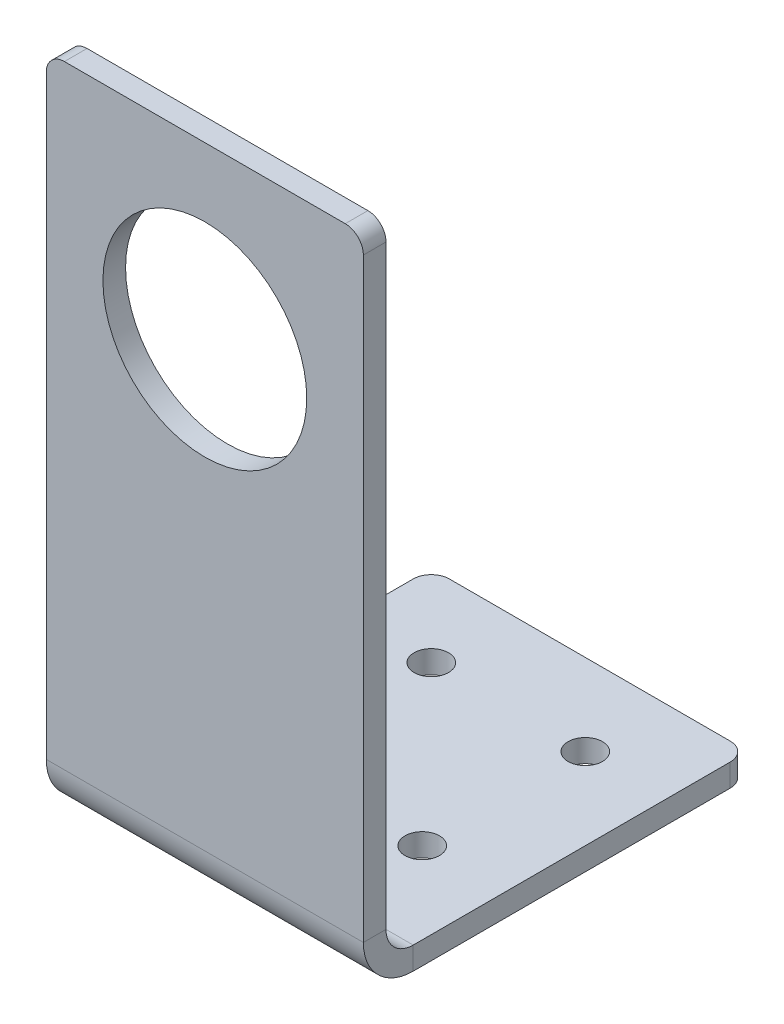
ISO-10303-21;
HEADER;
FILE_DESCRIPTION(('STEP AP214'),'2;1');
FILE_NAME('part.step','',(''),(''),'','','');
FILE_SCHEMA(('AUTOMOTIVE_DESIGN { 1 0 10303 214 1 1 1 1 }'));
ENDSEC;
DATA;
#1=APPLICATION_CONTEXT('core data for automotive mechanical design processes');
#2=APPLICATION_PROTOCOL_DEFINITION('international standard','automotive_design',2000,#1);
#3=PRODUCT_CONTEXT('',#1,'mechanical');
#4=PRODUCT('Part','Part','',(#3));
#5=PRODUCT_RELATED_PRODUCT_CATEGORY('part','',(#4));
#6=PRODUCT_DEFINITION_FORMATION('','',#4);
#7=PRODUCT_DEFINITION_CONTEXT('part definition',#1,'design');
#8=PRODUCT_DEFINITION('design','',#6,#7);
#9=PRODUCT_DEFINITION_SHAPE('','',#8);
#10=(LENGTH_UNIT() NAMED_UNIT(*) SI_UNIT(.MILLI.,.METRE.));
#11=(NAMED_UNIT(*) PLANE_ANGLE_UNIT() SI_UNIT($,.RADIAN.));
#12=(NAMED_UNIT(*) SI_UNIT($,.STERADIAN.) SOLID_ANGLE_UNIT());
#13=UNCERTAINTY_MEASURE_WITH_UNIT(LENGTH_MEASURE(1.E-05),#10,'distance_accuracy_value','');
#14=(GEOMETRIC_REPRESENTATION_CONTEXT(3) GLOBAL_UNCERTAINTY_ASSIGNED_CONTEXT((#13)) GLOBAL_UNIT_ASSIGNED_CONTEXT((#10,
#11,#12)) REPRESENTATION_CONTEXT('',''));
#15=CARTESIAN_POINT('',(0.,0.,0.));
#16=DIRECTION('',(0.,0.,1.));
#17=DIRECTION('',(1.,0.,0.));
#18=AXIS2_PLACEMENT_3D('',#15,#16,#17);
#19=CARTESIAN_POINT('',(22.225,-43.3168727915195,-50.8));
#20=DIRECTION('',(1.,0.,0.));
#21=DIRECTION('',(0.,0.,1.));
#22=AXIS2_PLACEMENT_3D('',#19,#20,#21);
#23=PLANE('',#22);
#24=DIRECTION('',(0.,1.,0.));
#25=VECTOR('',#24,1.);
#26=CARTESIAN_POINT('',(22.225,-43.3168727915195,-3.81));
#27=LINE('',#26,#25);
#28=CARTESIAN_POINT('',(22.225,-46.4918727915195,-3.81));
#29=VERTEX_POINT('',#28);
#30=CARTESIAN_POINT('',(22.225,-43.3168727915195,-3.81));
#31=VERTEX_POINT('',#30);
#32=EDGE_CURVE('E11',#29,#31,#27,.T.);
#33=ORIENTED_EDGE('',*,*,#32,.F.);
#34=DIRECTION('',(0.,0.,1.));
#35=VECTOR('',#34,1.);
#36=CARTESIAN_POINT('',(22.225,-46.4918727915195,-50.8));
#37=LINE('',#36,#35);
#38=CARTESIAN_POINT('',(22.225,-46.4918727915195,-48.26));
#39=VERTEX_POINT('',#38);
#40=EDGE_CURVE('E99',#39,#29,#37,.T.);
#41=ORIENTED_EDGE('',*,*,#40,.F.);
#42=DIRECTION('',(0.,1.,0.));
#43=VECTOR('',#42,1.);
#44=CARTESIAN_POINT('',(22.225,-43.3168727915195,-48.26));
#45=LINE('',#44,#43);
#46=CARTESIAN_POINT('',(22.225,-43.3168727915195,-48.26));
#47=VERTEX_POINT('',#46);
#48=EDGE_CURVE('E46',#39,#47,#45,.T.);
#49=ORIENTED_EDGE('',*,*,#48,.T.);
#50=DIRECTION('',(0.,0.,1.));
#51=VECTOR('',#50,1.);
#52=CARTESIAN_POINT('',(22.225,-43.3168727915195,-50.8));
#53=LINE('',#52,#51);
#54=EDGE_CURVE('E101',#47,#31,#53,.T.);
#55=ORIENTED_EDGE('',*,*,#54,.T.);
#56=EDGE_LOOP('',(#33,#41,#49,#55));
#57=FACE_BOUND('',#56,.T.);
#58=ADVANCED_FACE('F36',(#57),#23,.T.);
#59=CARTESIAN_POINT('',(19.685,-43.3168727915195,-48.26));
#60=DIRECTION('',(0.,-1.,0.));
#61=DIRECTION('',(1.,0.,0.));
#62=AXIS2_PLACEMENT_3D('',#59,#60,#61);
#63=CYLINDRICAL_SURFACE('',#62,2.54);
#64=ORIENTED_EDGE('',*,*,#48,.F.);
#65=CARTESIAN_POINT('',(19.685,-46.4918727915195,-48.26));
#66=DIRECTION('',(0.,-1.,0.));
#67=DIRECTION('',(1.,0.,0.));
#68=AXIS2_PLACEMENT_3D('',#65,#66,#67);
#69=CIRCLE('',#68,2.54);
#70=CARTESIAN_POINT('',(19.685,-46.4918727915195,-50.8));
#71=VERTEX_POINT('',#70);
#72=EDGE_CURVE('E126',#39,#71,#69,.F.);
#73=ORIENTED_EDGE('',*,*,#72,.T.);
#74=DIRECTION('',(0.,1.,0.));
#75=VECTOR('',#74,1.);
#76=CARTESIAN_POINT('',(19.685,-43.3168727915195,-50.8));
#77=LINE('',#76,#75);
#78=CARTESIAN_POINT('',(19.685,-43.3168727915195,-50.8));
#79=VERTEX_POINT('',#78);
#80=EDGE_CURVE('E164',#71,#79,#77,.T.);
#81=ORIENTED_EDGE('',*,*,#80,.T.);
#82=CARTESIAN_POINT('',(19.685,-43.3168727915195,-48.26));
#83=DIRECTION('',(0.,-1.,0.));
#84=DIRECTION('',(1.,0.,0.));
#85=AXIS2_PLACEMENT_3D('',#82,#83,#84);
#86=CIRCLE('',#85,2.54);
#87=EDGE_CURVE('E217',#47,#79,#86,.F.);
#88=ORIENTED_EDGE('',*,*,#87,.F.);
#89=EDGE_LOOP('',(#64,#73,#81,#88));
#90=FACE_BOUND('',#89,.T.);
#91=ADVANCED_FACE('F265',(#90),#63,.T.);
#92=CARTESIAN_POINT('',(22.225,-43.3168727915195,-50.8));
#93=DIRECTION('',(0.,0.,-1.));
#94=DIRECTION('',(1.,0.,0.));
#95=AXIS2_PLACEMENT_3D('',#92,#93,#94);
#96=PLANE('',#95);
#97=ORIENTED_EDGE('',*,*,#80,.F.);
#98=DIRECTION('',(1.,0.,0.));
#99=VECTOR('',#98,1.);
#100=CARTESIAN_POINT('',(22.225,-46.4918727915195,-50.8));
#101=LINE('',#100,#99);
#102=CARTESIAN_POINT('',(-19.685,-46.4918727915195,-50.8));
#103=VERTEX_POINT('',#102);
#104=EDGE_CURVE('E132',#103,#71,#101,.T.);
#105=ORIENTED_EDGE('',*,*,#104,.F.);
#106=DIRECTION('',(0.,1.,0.));
#107=VECTOR('',#106,1.);
#108=CARTESIAN_POINT('',(-19.685,-43.3168727915195,-50.8));
#109=LINE('',#108,#107);
#110=CARTESIAN_POINT('',(-19.685,-43.3168727915195,-50.8));
#111=VERTEX_POINT('',#110);
#112=EDGE_CURVE('E161',#103,#111,#109,.T.);
#113=ORIENTED_EDGE('',*,*,#112,.T.);
#114=DIRECTION('',(1.,0.,0.));
#115=VECTOR('',#114,1.);
#116=CARTESIAN_POINT('',(22.225,-43.3168727915195,-50.8));
#117=LINE('',#116,#115);
#118=EDGE_CURVE('E206',#111,#79,#117,.T.);
#119=ORIENTED_EDGE('',*,*,#118,.T.);
#120=EDGE_LOOP('',(#97,#105,#113,#119));
#121=FACE_BOUND('',#120,.T.);
#122=ADVANCED_FACE('F297',(#121),#96,.T.);
#123=CARTESIAN_POINT('',(-19.685,-43.3168727915195,-48.26));
#124=DIRECTION('',(0.,-1.,0.));
#125=DIRECTION('',(1.,0.,0.));
#126=AXIS2_PLACEMENT_3D('',#123,#124,#125);
#127=CYLINDRICAL_SURFACE('',#126,2.54);
#128=ORIENTED_EDGE('',*,*,#112,.F.);
#129=CARTESIAN_POINT('',(-19.685,-46.4918727915195,-48.26));
#130=DIRECTION('',(0.,-1.,0.));
#131=DIRECTION('',(1.,0.,0.));
#132=AXIS2_PLACEMENT_3D('',#129,#130,#131);
#133=CIRCLE('',#132,2.54);
#134=CARTESIAN_POINT('',(-22.225,-46.4918727915195,-48.26));
#135=VERTEX_POINT('',#134);
#136=EDGE_CURVE('E261',#103,#135,#133,.F.);
#137=ORIENTED_EDGE('',*,*,#136,.T.);
#138=DIRECTION('',(0.,1.,0.));
#139=VECTOR('',#138,1.);
#140=CARTESIAN_POINT('',(-22.225,-43.3168727915195,-48.26));
#141=LINE('',#140,#139);
#142=CARTESIAN_POINT('',(-22.225,-43.3168727915195,-48.26));
#143=VERTEX_POINT('',#142);
#144=EDGE_CURVE('E158',#135,#143,#141,.T.);
#145=ORIENTED_EDGE('',*,*,#144,.T.);
#146=CARTESIAN_POINT('',(-19.685,-43.3168727915195,-48.26));
#147=DIRECTION('',(0.,-1.,0.));
#148=DIRECTION('',(1.,0.,0.));
#149=AXIS2_PLACEMENT_3D('',#146,#147,#148);
#150=CIRCLE('',#149,2.54);
#151=EDGE_CURVE('E209',#111,#143,#150,.F.);
#152=ORIENTED_EDGE('',*,*,#151,.F.);
#153=EDGE_LOOP('',(#128,#137,#145,#152));
#154=FACE_BOUND('',#153,.T.);
#155=ADVANCED_FACE('F301',(#154),#127,.T.);
#156=CARTESIAN_POINT('',(-22.225,-43.3168727915195,-50.8));
#157=DIRECTION('',(1.,0.,0.));
#158=DIRECTION('',(0.,0.,1.));
#159=AXIS2_PLACEMENT_3D('',#156,#157,#158);
#160=PLANE('',#159);
#161=ORIENTED_EDGE('',*,*,#144,.F.);
#162=DIRECTION('',(0.,0.,1.));
#163=VECTOR('',#162,1.);
#164=CARTESIAN_POINT('',(-22.225,-46.4918727915195,-50.8));
#165=LINE('',#164,#163);
#166=CARTESIAN_POINT('',(-22.225,-46.4918727915195,-3.81));
#167=VERTEX_POINT('',#166);
#168=EDGE_CURVE('E127',#135,#167,#165,.T.);
#169=ORIENTED_EDGE('',*,*,#168,.T.);
#170=DIRECTION('',(0.,1.,0.));
#171=VECTOR('',#170,1.);
#172=CARTESIAN_POINT('',(-22.225,-43.3168727915195,-3.81));
#173=LINE('',#172,#171);
#174=CARTESIAN_POINT('',(-22.225,-43.3168727915195,-3.81));
#175=VERTEX_POINT('',#174);
#176=EDGE_CURVE('E155',#167,#175,#173,.T.);
#177=ORIENTED_EDGE('',*,*,#176,.T.);
#178=DIRECTION('',(0.,0.,1.));
#179=VECTOR('',#178,1.);
#180=CARTESIAN_POINT('',(-22.225,-43.3168727915195,-50.8));
#181=LINE('',#180,#179);
#182=EDGE_CURVE('E213',#143,#175,#181,.T.);
#183=ORIENTED_EDGE('',*,*,#182,.F.);
#184=EDGE_LOOP('',(#161,#169,#177,#183));
#185=FACE_BOUND('',#184,.T.);
#186=ADVANCED_FACE('F302',(#185),#160,.F.);
#187=CARTESIAN_POINT('',(-22.225,-39.5068727915195,-3.81));
#188=DIRECTION('',(1.,0.,0.));
#189=DIRECTION('',(0.,0.,-1.));
#190=AXIS2_PLACEMENT_3D('',#187,#188,#189);
#191=PLANE('',#190);
#192=ORIENTED_EDGE('',*,*,#176,.F.);
#193=CARTESIAN_POINT('',(-22.225,-39.5068727915195,-3.81));
#194=DIRECTION('',(1.,0.,0.));
#195=DIRECTION('',(0.,1.,0.));
#196=AXIS2_PLACEMENT_3D('',#193,#194,#195);
#197=CIRCLE('',#196,6.985);
#198=CARTESIAN_POINT('',(-22.225,-39.5068727915195,3.175));
#199=VERTEX_POINT('',#198);
#200=EDGE_CURVE('E115',#167,#199,#197,.F.);
#201=ORIENTED_EDGE('',*,*,#200,.T.);
#202=DIRECTION('',(0.,0.,-1.));
#203=VECTOR('',#202,1.);
#204=CARTESIAN_POINT('',(-22.225,-39.5068727915195,0.));
#205=LINE('',#204,#203);
#206=CARTESIAN_POINT('',(-22.225,-39.5068727915195,0.));
#207=VERTEX_POINT('',#206);
#208=EDGE_CURVE('E153',#199,#207,#205,.T.);
#209=ORIENTED_EDGE('',*,*,#208,.T.);
#210=CARTESIAN_POINT('',(-22.225,-39.5068727915195,-3.81));
#211=DIRECTION('',(-1.,0.,0.));
#212=DIRECTION('',(0.,0.,1.));
#213=AXIS2_PLACEMENT_3D('',#210,#211,#212);
#214=CIRCLE('',#213,3.81);
#215=EDGE_CURVE('E210',#175,#207,#214,.T.);
#216=ORIENTED_EDGE('',*,*,#215,.F.);
#217=EDGE_LOOP('',(#192,#201,#209,#216));
#218=FACE_BOUND('',#217,.T.);
#219=ADVANCED_FACE('F304',(#218),#191,.F.);
#220=CARTESIAN_POINT('',(-22.225,-46.4918727915195,0.));
#221=DIRECTION('',(1.,0.,0.));
#222=DIRECTION('',(0.,-1.,0.));
#223=AXIS2_PLACEMENT_3D('',#220,#221,#222);
#224=PLANE('',#223);
#225=ORIENTED_EDGE('',*,*,#208,.F.);
#226=DIRECTION('',(0.,1.,0.));
#227=VECTOR('',#226,1.);
#228=CARTESIAN_POINT('',(-22.225,43.9518727915195,3.175));
#229=LINE('',#228,#227);
#230=CARTESIAN_POINT('',(-22.225,43.9518727915194,3.175));
#231=VERTEX_POINT('',#230);
#232=EDGE_CURVE('E257',#231,#199,#229,.F.);
#233=ORIENTED_EDGE('',*,*,#232,.F.);
#234=DIRECTION('',(0.,0.,-1.));
#235=VECTOR('',#234,1.);
#236=CARTESIAN_POINT('',(-22.225,43.9518727915194,0.));
#237=LINE('',#236,#235);
#238=CARTESIAN_POINT('',(-22.225,43.9518727915194,0.));
#239=VERTEX_POINT('',#238);
#240=EDGE_CURVE('E150',#231,#239,#237,.T.);
#241=ORIENTED_EDGE('',*,*,#240,.T.);
#242=DIRECTION('',(0.,-1.,0.));
#243=VECTOR('',#242,1.);
#244=CARTESIAN_POINT('',(-22.225,-46.4918727915195,0.));
#245=LINE('',#244,#243);
#246=EDGE_CURVE('E220',#239,#207,#245,.T.);
#247=ORIENTED_EDGE('',*,*,#246,.T.);
#248=EDGE_LOOP('',(#225,#233,#241,#247));
#249=FACE_BOUND('',#248,.T.);
#250=ADVANCED_FACE('F310',(#249),#224,.F.);
#251=CARTESIAN_POINT('',(-19.685,43.9518727915195,0.));
#252=DIRECTION('',(0.,0.,-1.));
#253=DIRECTION('',(-1.,0.,0.));
#254=AXIS2_PLACEMENT_3D('',#251,#252,#253);
#255=CYLINDRICAL_SURFACE('',#254,2.54);
#256=ORIENTED_EDGE('',*,*,#240,.F.);
#257=CARTESIAN_POINT('',(-19.685,43.9518727915195,3.175));
#258=DIRECTION('',(0.,0.,1.));
#259=DIRECTION('',(1.,0.,0.));
#260=AXIS2_PLACEMENT_3D('',#257,#258,#259);
#261=CIRCLE('',#260,2.54);
#262=CARTESIAN_POINT('',(-19.685,46.4918727915195,3.175));
#263=VERTEX_POINT('',#262);
#264=EDGE_CURVE('E254',#263,#231,#261,.T.);
#265=ORIENTED_EDGE('',*,*,#264,.F.);
#266=DIRECTION('',(0.,0.,-1.));
#267=VECTOR('',#266,1.);
#268=CARTESIAN_POINT('',(-19.685,46.4918727915195,0.));
#269=LINE('',#268,#267);
#270=CARTESIAN_POINT('',(-19.685,46.4918727915195,0.));
#271=VERTEX_POINT('',#270);
#272=EDGE_CURVE('E147',#263,#271,#269,.T.);
#273=ORIENTED_EDGE('',*,*,#272,.T.);
#274=CARTESIAN_POINT('',(-19.685,43.9518727915195,0.));
#275=DIRECTION('',(0.,0.,1.));
#276=DIRECTION('',(-1.,0.,0.));
#277=AXIS2_PLACEMENT_3D('',#274,#275,#276);
#278=CIRCLE('',#277,2.54);
#279=EDGE_CURVE('E223',#271,#239,#278,.T.);
#280=ORIENTED_EDGE('',*,*,#279,.T.);
#281=EDGE_LOOP('',(#256,#265,#273,#280));
#282=FACE_BOUND('',#281,.T.);
#283=ADVANCED_FACE('F341',(#282),#255,.T.);
#284=CARTESIAN_POINT('',(-19.685,46.4918727915195,0.));
#285=DIRECTION('',(0.,-1.,0.));
#286=DIRECTION('',(-1.,0.,0.));
#287=AXIS2_PLACEMENT_3D('',#284,#285,#286);
#288=PLANE('',#287);
#289=ORIENTED_EDGE('',*,*,#272,.F.);
#290=DIRECTION('',(-1.,0.,0.));
#291=VECTOR('',#290,1.);
#292=CARTESIAN_POINT('',(-19.685,46.4918727915195,3.175));
#293=LINE('',#292,#291);
#294=CARTESIAN_POINT('',(19.685,46.4918727915195,3.175));
#295=VERTEX_POINT('',#294);
#296=EDGE_CURVE('E251',#295,#263,#293,.T.);
#297=ORIENTED_EDGE('',*,*,#296,.F.);
#298=DIRECTION('',(0.,0.,-1.));
#299=VECTOR('',#298,1.);
#300=CARTESIAN_POINT('',(19.685,46.4918727915195,0.));
#301=LINE('',#300,#299);
#302=CARTESIAN_POINT('',(19.685,46.4918727915195,0.));
#303=VERTEX_POINT('',#302);
#304=EDGE_CURVE('E144',#295,#303,#301,.T.);
#305=ORIENTED_EDGE('',*,*,#304,.T.);
#306=DIRECTION('',(-1.,0.,0.));
#307=VECTOR('',#306,1.);
#308=CARTESIAN_POINT('',(-19.685,46.4918727915195,0.));
#309=LINE('',#308,#307);
#310=EDGE_CURVE('E226',#303,#271,#309,.T.);
#311=ORIENTED_EDGE('',*,*,#310,.T.);
#312=EDGE_LOOP('',(#289,#297,#305,#311));
#313=FACE_BOUND('',#312,.T.);
#314=ADVANCED_FACE('F334',(#313),#288,.F.);
#315=CARTESIAN_POINT('',(19.685,43.9518727915195,0.));
#316=DIRECTION('',(0.,0.,-1.));
#317=DIRECTION('',(-1.,0.,0.));
#318=AXIS2_PLACEMENT_3D('',#315,#316,#317);
#319=CYLINDRICAL_SURFACE('',#318,2.54);
#320=ORIENTED_EDGE('',*,*,#304,.F.);
#321=CARTESIAN_POINT('',(19.685,43.9518727915195,3.175));
#322=DIRECTION('',(0.,0.,1.));
#323=DIRECTION('',(1.,0.,0.));
#324=AXIS2_PLACEMENT_3D('',#321,#322,#323);
#325=CIRCLE('',#324,2.54);
#326=CARTESIAN_POINT('',(22.225,43.9518727915194,3.175));
#327=VERTEX_POINT('',#326);
#328=EDGE_CURVE('E248',#327,#295,#325,.T.);
#329=ORIENTED_EDGE('',*,*,#328,.F.);
#330=DIRECTION('',(0.,0.,-1.));
#331=VECTOR('',#330,1.);
#332=CARTESIAN_POINT('',(22.225,43.9518727915194,0.));
#333=LINE('',#332,#331);
#334=CARTESIAN_POINT('',(22.225,43.9518727915194,0.));
#335=VERTEX_POINT('',#334);
#336=EDGE_CURVE('E141',#327,#335,#333,.T.);
#337=ORIENTED_EDGE('',*,*,#336,.T.);
#338=CARTESIAN_POINT('',(19.685,43.9518727915195,0.));
#339=DIRECTION('',(0.,0.,1.));
#340=DIRECTION('',(1.,0.,0.));
#341=AXIS2_PLACEMENT_3D('',#338,#339,#340);
#342=CIRCLE('',#341,2.54);
#343=EDGE_CURVE('E229',#335,#303,#342,.T.);
#344=ORIENTED_EDGE('',*,*,#343,.T.);
#345=EDGE_LOOP('',(#320,#329,#337,#344));
#346=FACE_BOUND('',#345,.T.);
#347=ADVANCED_FACE('F329',(#346),#319,.T.);
#348=CARTESIAN_POINT('',(22.225,-46.4918727915195,0.));
#349=DIRECTION('',(-1.,0.,0.));
#350=DIRECTION('',(0.,1.,0.));
#351=AXIS2_PLACEMENT_3D('',#348,#349,#350);
#352=PLANE('',#351);
#353=ORIENTED_EDGE('',*,*,#336,.F.);
#354=DIRECTION('',(0.,1.,0.));
#355=VECTOR('',#354,1.);
#356=CARTESIAN_POINT('',(22.225,43.9518727915195,3.175));
#357=LINE('',#356,#355);
#358=CARTESIAN_POINT('',(22.225,-39.5068727915195,3.175));
#359=VERTEX_POINT('',#358);
#360=EDGE_CURVE('E140',#359,#327,#357,.T.);
#361=ORIENTED_EDGE('',*,*,#360,.F.);
#362=DIRECTION('',(0.,0.,-1.));
#363=VECTOR('',#362,1.);
#364=CARTESIAN_POINT('',(22.225,-39.5068727915195,0.));
#365=LINE('',#364,#363);
#366=CARTESIAN_POINT('',(22.225,-39.5068727915195,0.));
#367=VERTEX_POINT('',#366);
#368=EDGE_CURVE('E55',#359,#367,#365,.T.);
#369=ORIENTED_EDGE('',*,*,#368,.T.);
#370=DIRECTION('',(0.,1.,0.));
#371=VECTOR('',#370,1.);
#372=CARTESIAN_POINT('',(22.225,-46.4918727915195,0.));
#373=LINE('',#372,#371);
#374=EDGE_CURVE('E232',#367,#335,#373,.T.);
#375=ORIENTED_EDGE('',*,*,#374,.T.);
#376=EDGE_LOOP('',(#353,#361,#369,#375));
#377=FACE_BOUND('',#376,.T.);
#378=ADVANCED_FACE('F322',(#377),#352,.F.);
#379=CARTESIAN_POINT('',(22.225,-39.5068727915195,-3.81));
#380=DIRECTION('',(1.,0.,0.));
#381=DIRECTION('',(0.,0.,-1.));
#382=AXIS2_PLACEMENT_3D('',#379,#380,#381);
#383=PLANE('',#382);
#384=CARTESIAN_POINT('',(22.225,-39.5068727915195,-3.81));
#385=DIRECTION('',(1.,0.,0.));
#386=DIRECTION('',(0.,1.,0.));
#387=AXIS2_PLACEMENT_3D('',#384,#385,#386);
#388=CIRCLE('',#387,6.985);
#389=EDGE_CURVE('E113',#359,#29,#388,.T.);
#390=ORIENTED_EDGE('',*,*,#389,.T.);
#391=ORIENTED_EDGE('',*,*,#32,.T.);
#392=CARTESIAN_POINT('',(22.225,-39.5068727915195,-3.81));
#393=DIRECTION('',(-1.,0.,0.));
#394=DIRECTION('',(0.,0.,1.));
#395=AXIS2_PLACEMENT_3D('',#392,#393,#394);
#396=CIRCLE('',#395,3.81);
#397=EDGE_CURVE('E241',#367,#31,#396,.F.);
#398=ORIENTED_EDGE('',*,*,#397,.F.);
#399=ORIENTED_EDGE('',*,*,#368,.F.);
#400=EDGE_LOOP('',(#390,#391,#398,#399));
#401=FACE_BOUND('',#400,.T.);
#402=ADVANCED_FACE('F129',(#401),#383,.T.);
#403=CARTESIAN_POINT('',(0.,22.5961272084805,0.));
#404=DIRECTION('',(0.,0.,-1.));
#405=DIRECTION('',(-1.,0.,0.));
#406=AXIS2_PLACEMENT_3D('',#403,#404,#405);
#407=CYLINDRICAL_SURFACE('',#406,14.2875);
#408=CARTESIAN_POINT('',(0.,22.5961272084805,0.));
#409=DIRECTION('',(0.,0.,1.));
#410=DIRECTION('',(1.,0.,0.));
#411=AXIS2_PLACEMENT_3D('',#408,#409,#410);
#412=CIRCLE('',#411,14.2875);
#413=CARTESIAN_POINT('',(14.2875,22.5961272084805,0.));
#414=VERTEX_POINT('',#413);
#415=EDGE_CURVE('E234',#414,#414,#412,.T.);
#416=ORIENTED_EDGE('',*,*,#415,.F.);
#417=EDGE_LOOP('',(#416));
#418=FACE_BOUND('',#417,.T.);
#419=CARTESIAN_POINT('',(0.,22.5961272084805,3.175));
#420=DIRECTION('',(0.,0.,1.));
#421=DIRECTION('',(1.,0.,0.));
#422=AXIS2_PLACEMENT_3D('',#419,#420,#421);
#423=CIRCLE('',#422,14.2875);
#424=CARTESIAN_POINT('',(14.2875,22.5961272084805,3.175));
#425=VERTEX_POINT('',#424);
#426=EDGE_CURVE('E120',#425,#425,#423,.T.);
#427=ORIENTED_EDGE('',*,*,#426,.T.);
#428=EDGE_LOOP('',(#427));
#429=FACE_BOUND('',#428,.T.);
#430=ADVANCED_FACE('F38',(#418,#429),#407,.F.);
#431=CARTESIAN_POINT('',(-19.685,43.9518727915195,0.));
#432=DIRECTION('',(0.,0.,-1.));
#433=DIRECTION('',(-1.,0.,0.));
#434=AXIS2_PLACEMENT_3D('',#431,#432,#433);
#435=PLANE('',#434);
#436=ORIENTED_EDGE('',*,*,#374,.F.);
#437=DIRECTION('',(1.,0.,0.));
#438=VECTOR('',#437,1.);
#439=CARTESIAN_POINT('',(-19.685,-39.5068727915195,0.));
#440=LINE('',#439,#438);
#441=EDGE_CURVE('E169',#367,#207,#440,.F.);
#442=ORIENTED_EDGE('',*,*,#441,.T.);
#443=ORIENTED_EDGE('',*,*,#246,.F.);
#444=ORIENTED_EDGE('',*,*,#279,.F.);
#445=ORIENTED_EDGE('',*,*,#310,.F.);
#446=ORIENTED_EDGE('',*,*,#343,.F.);
#447=EDGE_LOOP('',(#436,#442,#443,#444,#445,#446));
#448=FACE_BOUND('',#447,.T.);
#449=ORIENTED_EDGE('',*,*,#415,.T.);
#450=EDGE_LOOP('',(#449));
#451=FACE_BOUND('',#450,.T.);
#452=ADVANCED_FACE('F327',(#448,#451),#435,.T.);
#453=CARTESIAN_POINT('',(22.225,-43.3168727915195,-50.8));
#454=DIRECTION('',(0.,-1.,0.));
#455=DIRECTION('',(1.,0.,0.));
#456=AXIS2_PLACEMENT_3D('',#453,#454,#455);
#457=PLANE('',#456);
#458=CARTESIAN_POINT('',(10.795,-43.3168727915195,-39.37));
#459=DIRECTION('',(0.,1.,0.));
#460=DIRECTION('',(-1.,0.,0.));
#461=AXIS2_PLACEMENT_3D('',#458,#459,#460);
#462=CIRCLE('',#461,2.413);
#463=CARTESIAN_POINT('',(8.382,-43.3168727915195,-39.37));
#464=VERTEX_POINT('',#463);
#465=EDGE_CURVE('E199',#464,#464,#462,.T.);
#466=ORIENTED_EDGE('',*,*,#465,.F.);
#467=EDGE_LOOP('',(#466));
#468=FACE_BOUND('',#467,.T.);
#469=CARTESIAN_POINT('',(-10.795,-43.3168727915195,-16.51));
#470=DIRECTION('',(0.,1.,0.));
#471=DIRECTION('',(-1.,0.,0.));
#472=AXIS2_PLACEMENT_3D('',#469,#470,#471);
#473=CIRCLE('',#472,2.413);
#474=CARTESIAN_POINT('',(-13.208,-43.3168727915195,-16.51));
#475=VERTEX_POINT('',#474);
#476=EDGE_CURVE('E202',#475,#475,#473,.T.);
#477=ORIENTED_EDGE('',*,*,#476,.F.);
#478=EDGE_LOOP('',(#477));
#479=FACE_BOUND('',#478,.T.);
#480=CARTESIAN_POINT('',(10.795,-43.3168727915195,-16.51));
#481=DIRECTION('',(0.,1.,0.));
#482=DIRECTION('',(-1.,0.,0.));
#483=AXIS2_PLACEMENT_3D('',#480,#481,#482);
#484=CIRCLE('',#483,2.413);
#485=CARTESIAN_POINT('',(8.382,-43.3168727915195,-16.51));
#486=VERTEX_POINT('',#485);
#487=EDGE_CURVE('E391',#486,#486,#484,.T.);
#488=ORIENTED_EDGE('',*,*,#487,.F.);
#489=EDGE_LOOP('',(#488));
#490=FACE_BOUND('',#489,.T.);
#491=CARTESIAN_POINT('',(-10.795,-43.3168727915195,-39.37));
#492=DIRECTION('',(0.,1.,0.));
#493=DIRECTION('',(-1.,0.,0.));
#494=AXIS2_PLACEMENT_3D('',#491,#492,#493);
#495=CIRCLE('',#494,2.413);
#496=CARTESIAN_POINT('',(-13.208,-43.3168727915195,-39.37));
#497=VERTEX_POINT('',#496);
#498=EDGE_CURVE('E174',#497,#497,#495,.T.);
#499=ORIENTED_EDGE('',*,*,#498,.F.);
#500=EDGE_LOOP('',(#499));
#501=FACE_BOUND('',#500,.T.);
#502=ORIENTED_EDGE('',*,*,#182,.T.);
#503=DIRECTION('',(1.,0.,0.));
#504=VECTOR('',#503,1.);
#505=CARTESIAN_POINT('',(22.225,-43.3168727915195,-3.81));
#506=LINE('',#505,#504);
#507=EDGE_CURVE('E237',#175,#31,#506,.T.);
#508=ORIENTED_EDGE('',*,*,#507,.T.);
#509=ORIENTED_EDGE('',*,*,#54,.F.);
#510=ORIENTED_EDGE('',*,*,#87,.T.);
#511=ORIENTED_EDGE('',*,*,#118,.F.);
#512=ORIENTED_EDGE('',*,*,#151,.T.);
#513=EDGE_LOOP('',(#502,#508,#509,#510,#511,#512));
#514=FACE_BOUND('',#513,.T.);
#515=ADVANCED_FACE('F272',(#468,#479,#490,#501,#514),#457,.F.);
#516=CARTESIAN_POINT('',(22.225,-39.5068727915195,-3.81));
#517=DIRECTION('',(1.,0.,0.));
#518=DIRECTION('',(0.,1.,0.));
#519=AXIS2_PLACEMENT_3D('',#516,#517,#518);
#520=CYLINDRICAL_SURFACE('',#519,3.81);
#521=ORIENTED_EDGE('',*,*,#215,.T.);
#522=ORIENTED_EDGE('',*,*,#441,.F.);
#523=ORIENTED_EDGE('',*,*,#397,.T.);
#524=ORIENTED_EDGE('',*,*,#507,.F.);
#525=EDGE_LOOP('',(#521,#522,#523,#524));
#526=FACE_BOUND('',#525,.T.);
#527=ADVANCED_FACE('F279',(#526),#520,.F.);
#528=CARTESIAN_POINT('',(-19.685,43.9518727915195,3.175));
#529=DIRECTION('',(0.,0.,-1.));
#530=DIRECTION('',(-1.,0.,0.));
#531=AXIS2_PLACEMENT_3D('',#528,#529,#530);
#532=PLANE('',#531);
#533=ORIENTED_EDGE('',*,*,#360,.T.);
#534=ORIENTED_EDGE('',*,*,#328,.T.);
#535=ORIENTED_EDGE('',*,*,#296,.T.);
#536=ORIENTED_EDGE('',*,*,#264,.T.);
#537=ORIENTED_EDGE('',*,*,#232,.T.);
#538=DIRECTION('',(-1.,0.,0.));
#539=VECTOR('',#538,1.);
#540=CARTESIAN_POINT('',(-19.685,-39.5068727915195,3.175));
#541=LINE('',#540,#539);
#542=EDGE_CURVE('E119',#359,#199,#541,.T.);
#543=ORIENTED_EDGE('',*,*,#542,.F.);
#544=EDGE_LOOP('',(#533,#534,#535,#536,#537,#543));
#545=FACE_BOUND('',#544,.T.);
#546=ORIENTED_EDGE('',*,*,#426,.F.);
#547=EDGE_LOOP('',(#546));
#548=FACE_BOUND('',#547,.T.);
#549=ADVANCED_FACE('F184',(#545,#548),#532,.F.);
#550=CARTESIAN_POINT('',(22.225,-46.4918727915195,-50.8));
#551=DIRECTION('',(0.,-1.,0.));
#552=DIRECTION('',(1.,0.,0.));
#553=AXIS2_PLACEMENT_3D('',#550,#551,#552);
#554=PLANE('',#553);
#555=CARTESIAN_POINT('',(10.795,-46.4918727915195,-39.37));
#556=DIRECTION('',(0.,-1.,0.));
#557=DIRECTION('',(1.,0.,0.));
#558=AXIS2_PLACEMENT_3D('',#555,#556,#557);
#559=CIRCLE('',#558,2.413);
#560=CARTESIAN_POINT('',(13.208,-46.4918727915195,-39.37));
#561=VERTEX_POINT('',#560);
#562=EDGE_CURVE('E40',#561,#561,#559,.T.);
#563=ORIENTED_EDGE('',*,*,#562,.F.);
#564=EDGE_LOOP('',(#563));
#565=FACE_BOUND('',#564,.T.);
#566=CARTESIAN_POINT('',(-10.795,-46.4918727915195,-16.51));
#567=DIRECTION('',(0.,-1.,0.));
#568=DIRECTION('',(1.,0.,0.));
#569=AXIS2_PLACEMENT_3D('',#566,#567,#568);
#570=CIRCLE('',#569,2.413);
#571=CARTESIAN_POINT('',(-8.382,-46.4918727915195,-16.51));
#572=VERTEX_POINT('',#571);
#573=EDGE_CURVE('E135',#572,#572,#570,.T.);
#574=ORIENTED_EDGE('',*,*,#573,.F.);
#575=EDGE_LOOP('',(#574));
#576=FACE_BOUND('',#575,.T.);
#577=CARTESIAN_POINT('',(10.795,-46.4918727915195,-16.51));
#578=DIRECTION('',(0.,-1.,0.));
#579=DIRECTION('',(1.,0.,0.));
#580=AXIS2_PLACEMENT_3D('',#577,#578,#579);
#581=CIRCLE('',#580,2.413);
#582=CARTESIAN_POINT('',(13.208,-46.4918727915195,-16.51));
#583=VERTEX_POINT('',#582);
#584=EDGE_CURVE('E173',#583,#583,#581,.T.);
#585=ORIENTED_EDGE('',*,*,#584,.F.);
#586=EDGE_LOOP('',(#585));
#587=FACE_BOUND('',#586,.T.);
#588=CARTESIAN_POINT('',(-10.795,-46.4918727915195,-39.37));
#589=DIRECTION('',(0.,-1.,0.));
#590=DIRECTION('',(1.,0.,0.));
#591=AXIS2_PLACEMENT_3D('',#588,#589,#590);
#592=CIRCLE('',#591,2.413);
#593=CARTESIAN_POINT('',(-8.382,-46.4918727915195,-39.37));
#594=VERTEX_POINT('',#593);
#595=EDGE_CURVE('E170',#594,#594,#592,.T.);
#596=ORIENTED_EDGE('',*,*,#595,.F.);
#597=EDGE_LOOP('',(#596));
#598=FACE_BOUND('',#597,.T.);
#599=ORIENTED_EDGE('',*,*,#168,.F.);
#600=ORIENTED_EDGE('',*,*,#136,.F.);
#601=ORIENTED_EDGE('',*,*,#104,.T.);
#602=ORIENTED_EDGE('',*,*,#72,.F.);
#603=ORIENTED_EDGE('',*,*,#40,.T.);
#604=DIRECTION('',(1.,0.,0.));
#605=VECTOR('',#604,1.);
#606=CARTESIAN_POINT('',(22.225,-46.4918727915195,-3.81));
#607=LINE('',#606,#605);
#608=EDGE_CURVE('E110',#167,#29,#607,.T.);
#609=ORIENTED_EDGE('',*,*,#608,.F.);
#610=EDGE_LOOP('',(#599,#600,#601,#602,#603,#609));
#611=FACE_BOUND('',#610,.T.);
#612=ADVANCED_FACE('F123',(#565,#576,#587,#598,#611),#554,.T.);
#613=CARTESIAN_POINT('',(22.225,-39.5068727915195,-3.81));
#614=DIRECTION('',(1.,0.,0.));
#615=DIRECTION('',(0.,1.,0.));
#616=AXIS2_PLACEMENT_3D('',#613,#614,#615);
#617=CYLINDRICAL_SURFACE('',#616,6.985);
#618=ORIENTED_EDGE('',*,*,#200,.F.);
#619=ORIENTED_EDGE('',*,*,#608,.T.);
#620=ORIENTED_EDGE('',*,*,#389,.F.);
#621=ORIENTED_EDGE('',*,*,#542,.T.);
#622=EDGE_LOOP('',(#618,#619,#620,#621));
#623=FACE_BOUND('',#622,.T.);
#624=ADVANCED_FACE('F111',(#623),#617,.T.);
#625=CARTESIAN_POINT('',(-10.795,-94.1168727915195,-39.37));
#626=DIRECTION('',(0.,1.,0.));
#627=DIRECTION('',(-1.,0.,0.));
#628=AXIS2_PLACEMENT_3D('',#625,#626,#627);
#629=CYLINDRICAL_SURFACE('',#628,2.413);
#630=ORIENTED_EDGE('',*,*,#595,.T.);
#631=EDGE_LOOP('',(#630));
#632=FACE_BOUND('',#631,.T.);
#633=ORIENTED_EDGE('',*,*,#498,.T.);
#634=EDGE_LOOP('',(#633));
#635=FACE_BOUND('',#634,.T.);
#636=ADVANCED_FACE('F191',(#632,#635),#629,.F.);
#637=CARTESIAN_POINT('',(10.795,-94.1168727915195,-16.51));
#638=DIRECTION('',(0.,1.,0.));
#639=DIRECTION('',(-1.,0.,0.));
#640=AXIS2_PLACEMENT_3D('',#637,#638,#639);
#641=CYLINDRICAL_SURFACE('',#640,2.413);
#642=ORIENTED_EDGE('',*,*,#584,.T.);
#643=EDGE_LOOP('',(#642));
#644=FACE_BOUND('',#643,.T.);
#645=ORIENTED_EDGE('',*,*,#487,.T.);
#646=EDGE_LOOP('',(#645));
#647=FACE_BOUND('',#646,.T.);
#648=ADVANCED_FACE('F194',(#644,#647),#641,.F.);
#649=CARTESIAN_POINT('',(-10.795,-94.1168727915195,-16.51));
#650=DIRECTION('',(0.,1.,0.));
#651=DIRECTION('',(-1.,0.,0.));
#652=AXIS2_PLACEMENT_3D('',#649,#650,#651);
#653=CYLINDRICAL_SURFACE('',#652,2.413);
#654=ORIENTED_EDGE('',*,*,#573,.T.);
#655=EDGE_LOOP('',(#654));
#656=FACE_BOUND('',#655,.T.);
#657=ORIENTED_EDGE('',*,*,#476,.T.);
#658=EDGE_LOOP('',(#657));
#659=FACE_BOUND('',#658,.T.);
#660=ADVANCED_FACE('F179',(#656,#659),#653,.F.);
#661=CARTESIAN_POINT('',(10.795,-94.1168727915195,-39.37));
#662=DIRECTION('',(0.,1.,0.));
#663=DIRECTION('',(-1.,0.,0.));
#664=AXIS2_PLACEMENT_3D('',#661,#662,#663);
#665=CYLINDRICAL_SURFACE('',#664,2.413);
#666=ORIENTED_EDGE('',*,*,#562,.T.);
#667=EDGE_LOOP('',(#666));
#668=FACE_BOUND('',#667,.T.);
#669=ORIENTED_EDGE('',*,*,#465,.T.);
#670=EDGE_LOOP('',(#669));
#671=FACE_BOUND('',#670,.T.);
#672=ADVANCED_FACE('F380',(#668,#671),#665,.F.);
#673=CLOSED_SHELL('',(#58,#91,#122,#155,#186,#219,#250,#283,#314,#347,#378,#402,#430,#452,#515,
#527,#549,#612,#624,#636,#648,#660,#672));
#674=MANIFOLD_SOLID_BREP('B2',#673);
#675=ADVANCED_BREP_SHAPE_REPRESENTATION('',(#18,#674),#14);
#676=SHAPE_DEFINITION_REPRESENTATION(#9,#675);
ENDSEC;
END-ISO-10303-21;
